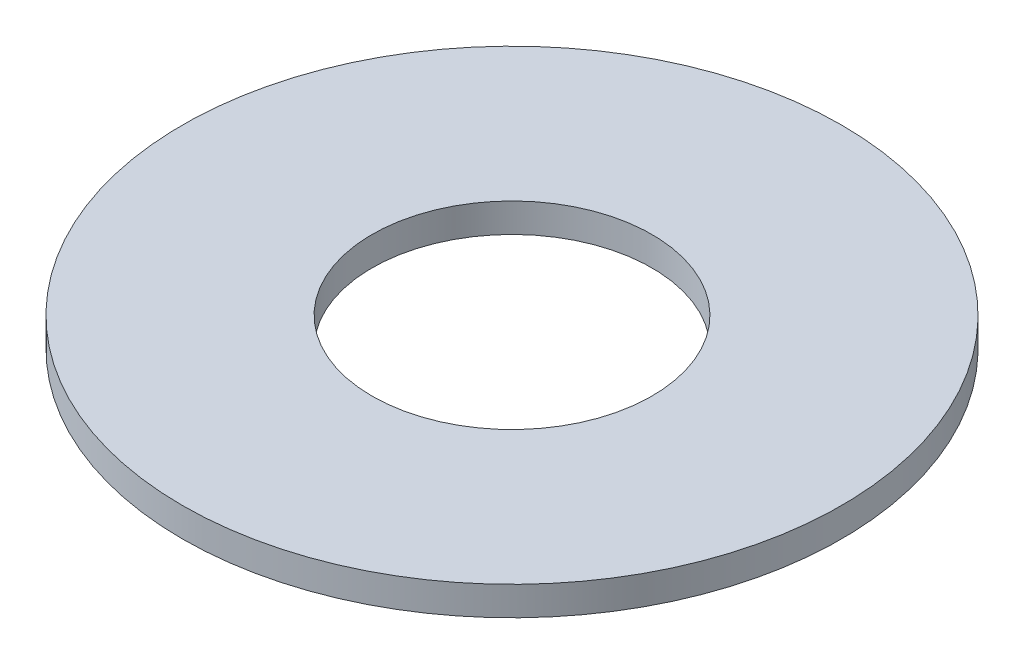
ISO-10303-21;
HEADER;
FILE_DESCRIPTION(('STEP AP214'),'2;1');
FILE_NAME('part.step','',(''),(''),'','','');
FILE_SCHEMA(('AUTOMOTIVE_DESIGN { 1 0 10303 214 1 1 1 1 }'));
ENDSEC;
DATA;
#1=APPLICATION_CONTEXT('core data for automotive mechanical design processes');
#2=APPLICATION_PROTOCOL_DEFINITION('international standard','automotive_design',2000,#1);
#3=PRODUCT_CONTEXT('',#1,'mechanical');
#4=PRODUCT('Part','Part','',(#3));
#5=PRODUCT_RELATED_PRODUCT_CATEGORY('part','',(#4));
#6=PRODUCT_DEFINITION_FORMATION('','',#4);
#7=PRODUCT_DEFINITION_CONTEXT('part definition',#1,'design');
#8=PRODUCT_DEFINITION('design','',#6,#7);
#9=PRODUCT_DEFINITION_SHAPE('','',#8);
#10=(LENGTH_UNIT() NAMED_UNIT(*) SI_UNIT(.MILLI.,.METRE.));
#11=(NAMED_UNIT(*) PLANE_ANGLE_UNIT() SI_UNIT($,.RADIAN.));
#12=(NAMED_UNIT(*) SI_UNIT($,.STERADIAN.) SOLID_ANGLE_UNIT());
#13=UNCERTAINTY_MEASURE_WITH_UNIT(LENGTH_MEASURE(1.E-05),#10,'distance_accuracy_value','');
#14=(GEOMETRIC_REPRESENTATION_CONTEXT(3) GLOBAL_UNCERTAINTY_ASSIGNED_CONTEXT((#13)) GLOBAL_UNIT_ASSIGNED_CONTEXT((#10,
#11,#12)) REPRESENTATION_CONTEXT('',''));
#15=CARTESIAN_POINT('',(0.,0.,0.));
#16=DIRECTION('',(0.,0.,1.));
#17=DIRECTION('',(1.,0.,0.));
#18=AXIS2_PLACEMENT_3D('',#15,#16,#17);
#19=CARTESIAN_POINT('',(0.,1.397,0.));
#20=DIRECTION('',(0.,-1.,0.));
#21=DIRECTION('',(0.,0.,-1.));
#22=AXIS2_PLACEMENT_3D('',#19,#20,#21);
#23=CYLINDRICAL_SURFACE('',#22,15.875);
#24=CARTESIAN_POINT('',(0.,1.397,0.));
#25=DIRECTION('',(0.,1.,0.));
#26=DIRECTION('',(0.,0.,1.));
#27=AXIS2_PLACEMENT_3D('',#24,#25,#26);
#28=CIRCLE('',#27,15.875);
#29=CARTESIAN_POINT('',(0.,1.397,15.875));
#30=VERTEX_POINT('',#29);
#31=EDGE_CURVE('E10',#30,#30,#28,.T.);
#32=ORIENTED_EDGE('',*,*,#31,.F.);
#33=EDGE_LOOP('',(#32));
#34=FACE_BOUND('',#33,.T.);
#35=CARTESIAN_POINT('',(0.,0.,0.));
#36=DIRECTION('',(0.,1.,0.));
#37=DIRECTION('',(0.,0.,1.));
#38=AXIS2_PLACEMENT_3D('',#35,#36,#37);
#39=CIRCLE('',#38,15.875);
#40=CARTESIAN_POINT('',(0.,0.,15.875));
#41=VERTEX_POINT('',#40);
#42=EDGE_CURVE('E36',#41,#41,#39,.T.);
#43=ORIENTED_EDGE('',*,*,#42,.T.);
#44=EDGE_LOOP('',(#43));
#45=FACE_BOUND('',#44,.T.);
#46=ADVANCED_FACE('F33',(#34,#45),#23,.T.);
#47=CARTESIAN_POINT('',(0.,1.397,0.));
#48=DIRECTION('',(0.,1.,0.));
#49=DIRECTION('',(0.,0.,1.));
#50=AXIS2_PLACEMENT_3D('',#47,#48,#49);
#51=PLANE('',#50);
#52=CARTESIAN_POINT('',(0.,1.397,0.));
#53=DIRECTION('',(0.,1.,0.));
#54=DIRECTION('',(0.,0.,1.));
#55=AXIS2_PLACEMENT_3D('',#52,#53,#54);
#56=CIRCLE('',#55,6.7437);
#57=CARTESIAN_POINT('',(0.,1.397,6.7437));
#58=VERTEX_POINT('',#57);
#59=EDGE_CURVE('E45',#58,#58,#56,.T.);
#60=ORIENTED_EDGE('',*,*,#59,.F.);
#61=EDGE_LOOP('',(#60));
#62=FACE_BOUND('',#61,.T.);
#63=ORIENTED_EDGE('',*,*,#31,.T.);
#64=EDGE_LOOP('',(#63));
#65=FACE_BOUND('',#64,.T.);
#66=ADVANCED_FACE('F60',(#62,#65),#51,.T.);
#67=CARTESIAN_POINT('',(0.,0.,0.));
#68=DIRECTION('',(0.,1.,0.));
#69=DIRECTION('',(0.,0.,1.));
#70=AXIS2_PLACEMENT_3D('',#67,#68,#69);
#71=PLANE('',#70);
#72=CARTESIAN_POINT('',(0.,0.,0.));
#73=DIRECTION('',(0.,1.,0.));
#74=DIRECTION('',(0.,0.,1.));
#75=AXIS2_PLACEMENT_3D('',#72,#73,#74);
#76=CIRCLE('',#75,6.7437);
#77=CARTESIAN_POINT('',(0.,0.,6.7437));
#78=VERTEX_POINT('',#77);
#79=EDGE_CURVE('E43',#78,#78,#76,.T.);
#80=ORIENTED_EDGE('',*,*,#79,.T.);
#81=EDGE_LOOP('',(#80));
#82=FACE_BOUND('',#81,.T.);
#83=ORIENTED_EDGE('',*,*,#42,.F.);
#84=EDGE_LOOP('',(#83));
#85=FACE_BOUND('',#84,.T.);
#86=ADVANCED_FACE('F51',(#82,#85),#71,.F.);
#87=CARTESIAN_POINT('',(0.,0.,0.));
#88=DIRECTION('',(0.,1.,0.));
#89=DIRECTION('',(0.,0.,1.));
#90=AXIS2_PLACEMENT_3D('',#87,#88,#89);
#91=CYLINDRICAL_SURFACE('',#90,6.7437);
#92=ORIENTED_EDGE('',*,*,#79,.F.);
#93=EDGE_LOOP('',(#92));
#94=FACE_BOUND('',#93,.T.);
#95=ORIENTED_EDGE('',*,*,#59,.T.);
#96=EDGE_LOOP('',(#95));
#97=FACE_BOUND('',#96,.T.);
#98=ADVANCED_FACE('F54',(#94,#97),#91,.F.);
#99=CLOSED_SHELL('',(#46,#66,#86,#98));
#100=MANIFOLD_SOLID_BREP('B2',#99);
#101=ADVANCED_BREP_SHAPE_REPRESENTATION('',(#18,#100),#14);
#102=SHAPE_DEFINITION_REPRESENTATION(#9,#101);
ENDSEC;
END-ISO-10303-21;
